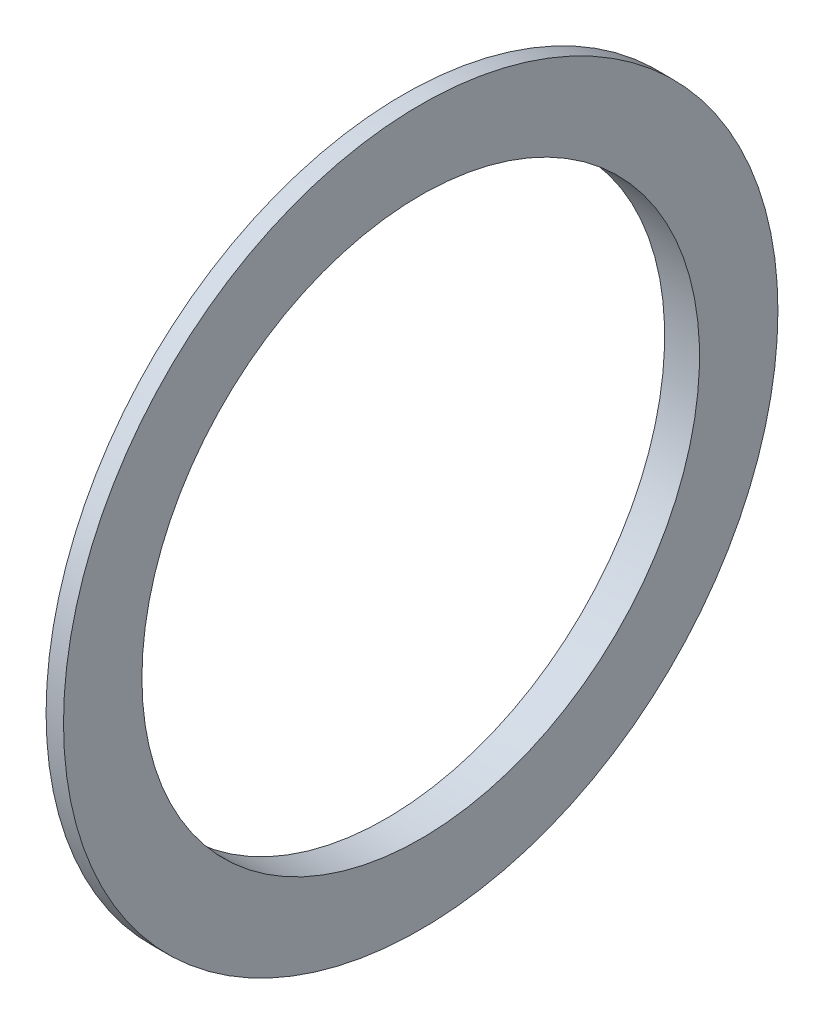
ISO-10303-21;
HEADER;
FILE_DESCRIPTION(('STEP AP214'),'2;1');
FILE_NAME('part.step','',(''),(''),'','','');
FILE_SCHEMA(('AUTOMOTIVE_DESIGN { 1 0 10303 214 1 1 1 1 }'));
ENDSEC;
DATA;
#1=APPLICATION_CONTEXT('core data for automotive mechanical design processes');
#2=APPLICATION_PROTOCOL_DEFINITION('international standard','automotive_design',2000,#1);
#3=PRODUCT_CONTEXT('',#1,'mechanical');
#4=PRODUCT('Part','Part','',(#3));
#5=PRODUCT_RELATED_PRODUCT_CATEGORY('part','',(#4));
#6=PRODUCT_DEFINITION_FORMATION('','',#4);
#7=PRODUCT_DEFINITION_CONTEXT('part definition',#1,'design');
#8=PRODUCT_DEFINITION('design','',#6,#7);
#9=PRODUCT_DEFINITION_SHAPE('','',#8);
#10=(LENGTH_UNIT() NAMED_UNIT(*) SI_UNIT(.MILLI.,.METRE.));
#11=(NAMED_UNIT(*) PLANE_ANGLE_UNIT() SI_UNIT($,.RADIAN.));
#12=(NAMED_UNIT(*) SI_UNIT($,.STERADIAN.) SOLID_ANGLE_UNIT());
#13=UNCERTAINTY_MEASURE_WITH_UNIT(LENGTH_MEASURE(1.E-05),#10,'distance_accuracy_value','');
#14=(GEOMETRIC_REPRESENTATION_CONTEXT(3) GLOBAL_UNCERTAINTY_ASSIGNED_CONTEXT((#13)) GLOBAL_UNIT_ASSIGNED_CONTEXT((#10,
#11,#12)) REPRESENTATION_CONTEXT('',''));
#15=CARTESIAN_POINT('',(0.,0.,0.));
#16=DIRECTION('',(0.,0.,1.));
#17=DIRECTION('',(1.,0.,0.));
#18=AXIS2_PLACEMENT_3D('',#15,#16,#17);
#19=CARTESIAN_POINT('',(0.,0.,0.));
#20=DIRECTION('',(-1.,0.,0.));
#21=DIRECTION('',(0.,0.,1.));
#22=AXIS2_PLACEMENT_3D('',#19,#20,#21);
#23=CYLINDRICAL_SURFACE('',#22,16.);
#24=CARTESIAN_POINT('',(155.342300415039,0.,0.));
#25=DIRECTION('',(-1.,0.,0.));
#26=DIRECTION('',(0.,0.,1.));
#27=AXIS2_PLACEMENT_3D('',#24,#25,#26);
#28=CIRCLE('',#27,16.);
#29=CARTESIAN_POINT('',(155.342300415039,0.,16.));
#30=VERTEX_POINT('',#29);
#31=EDGE_CURVE('E50',#30,#30,#28,.T.);
#32=ORIENTED_EDGE('',*,*,#31,.F.);
#33=EDGE_LOOP('',(#32));
#34=FACE_BOUND('',#33,.T.);
#35=CARTESIAN_POINT('',(153.342300415039,0.,0.));
#36=DIRECTION('',(-1.,0.,0.));
#37=DIRECTION('',(0.,0.,1.));
#38=AXIS2_PLACEMENT_3D('',#35,#36,#37);
#39=CIRCLE('',#38,16.);
#40=CARTESIAN_POINT('',(153.342300415039,0.,16.));
#41=VERTEX_POINT('',#40);
#42=EDGE_CURVE('E10',#41,#41,#39,.T.);
#43=ORIENTED_EDGE('',*,*,#42,.T.);
#44=EDGE_LOOP('',(#43));
#45=FACE_BOUND('',#44,.T.);
#46=ADVANCED_FACE('F31',(#34,#45),#23,.F.);
#47=CARTESIAN_POINT('',(153.342300415039,16.,0.));
#48=DIRECTION('',(1.,0.,0.));
#49=DIRECTION('',(0.,0.,-1.));
#50=AXIS2_PLACEMENT_3D('',#47,#48,#49);
#51=PLANE('',#50);
#52=ORIENTED_EDGE('',*,*,#42,.F.);
#53=EDGE_LOOP('',(#52));
#54=FACE_BOUND('',#53,.T.);
#55=CARTESIAN_POINT('',(153.342300415039,0.,0.));
#56=DIRECTION('',(-1.,0.,0.));
#57=DIRECTION('',(0.,0.,1.));
#58=AXIS2_PLACEMENT_3D('',#55,#56,#57);
#59=CIRCLE('',#58,17.5);
#60=CARTESIAN_POINT('',(153.342300415039,0.,17.5));
#61=VERTEX_POINT('',#60);
#62=EDGE_CURVE('E37',#61,#61,#59,.T.);
#63=ORIENTED_EDGE('',*,*,#62,.T.);
#64=EDGE_LOOP('',(#63));
#65=FACE_BOUND('',#64,.T.);
#66=ADVANCED_FACE('F57',(#54,#65),#51,.F.);
#67=CARTESIAN_POINT('',(154.342300415039,0.,0.));
#68=DIRECTION('',(1.,0.,0.));
#69=DIRECTION('',(0.,0.,-1.));
#70=AXIS2_PLACEMENT_3D('',#67,#68,#69);
#71=CONICAL_SURFACE('',#70,20.5,1.24904577239826);
#72=ORIENTED_EDGE('',*,*,#62,.F.);
#73=EDGE_LOOP('',(#72));
#74=FACE_BOUND('',#73,.T.);
#75=CARTESIAN_POINT('',(154.342300415039,0.,0.));
#76=DIRECTION('',(-1.,0.,0.));
#77=DIRECTION('',(0.,0.,1.));
#78=AXIS2_PLACEMENT_3D('',#75,#76,#77);
#79=CIRCLE('',#78,20.5);
#80=CARTESIAN_POINT('',(154.342300415039,0.,20.5));
#81=VERTEX_POINT('',#80);
#82=EDGE_CURVE('E41',#81,#81,#79,.T.);
#83=ORIENTED_EDGE('',*,*,#82,.T.);
#84=EDGE_LOOP('',(#83));
#85=FACE_BOUND('',#84,.T.);
#86=ADVANCED_FACE('F61',(#74,#85),#71,.T.);
#87=CARTESIAN_POINT('',(0.,0.,0.));
#88=DIRECTION('',(-1.,0.,0.));
#89=DIRECTION('',(0.,0.,1.));
#90=AXIS2_PLACEMENT_3D('',#87,#88,#89);
#91=CYLINDRICAL_SURFACE('',#90,20.5);
#92=ORIENTED_EDGE('',*,*,#82,.F.);
#93=EDGE_LOOP('',(#92));
#94=FACE_BOUND('',#93,.T.);
#95=CARTESIAN_POINT('',(155.342300415039,0.,0.));
#96=DIRECTION('',(-1.,0.,0.));
#97=DIRECTION('',(0.,0.,1.));
#98=AXIS2_PLACEMENT_3D('',#95,#96,#97);
#99=CIRCLE('',#98,20.5);
#100=CARTESIAN_POINT('',(155.342300415039,0.,20.5));
#101=VERTEX_POINT('',#100);
#102=EDGE_CURVE('E45',#101,#101,#99,.T.);
#103=ORIENTED_EDGE('',*,*,#102,.T.);
#104=EDGE_LOOP('',(#103));
#105=FACE_BOUND('',#104,.T.);
#106=ADVANCED_FACE('F66',(#94,#105),#91,.T.);
#107=CARTESIAN_POINT('',(155.342300415039,20.5,0.));
#108=DIRECTION('',(-1.,0.,0.));
#109=DIRECTION('',(0.,0.,1.));
#110=AXIS2_PLACEMENT_3D('',#107,#108,#109);
#111=PLANE('',#110);
#112=ORIENTED_EDGE('',*,*,#102,.F.);
#113=EDGE_LOOP('',(#112));
#114=FACE_BOUND('',#113,.T.);
#115=ORIENTED_EDGE('',*,*,#31,.T.);
#116=EDGE_LOOP('',(#115));
#117=FACE_BOUND('',#116,.T.);
#118=ADVANCED_FACE('F54',(#114,#117),#111,.F.);
#119=CLOSED_SHELL('',(#46,#66,#86,#106,#118));
#120=MANIFOLD_SOLID_BREP('B2',#119);
#121=ADVANCED_BREP_SHAPE_REPRESENTATION('',(#18,#120),#14);
#122=SHAPE_DEFINITION_REPRESENTATION(#9,#121);
ENDSEC;
END-ISO-10303-21;
